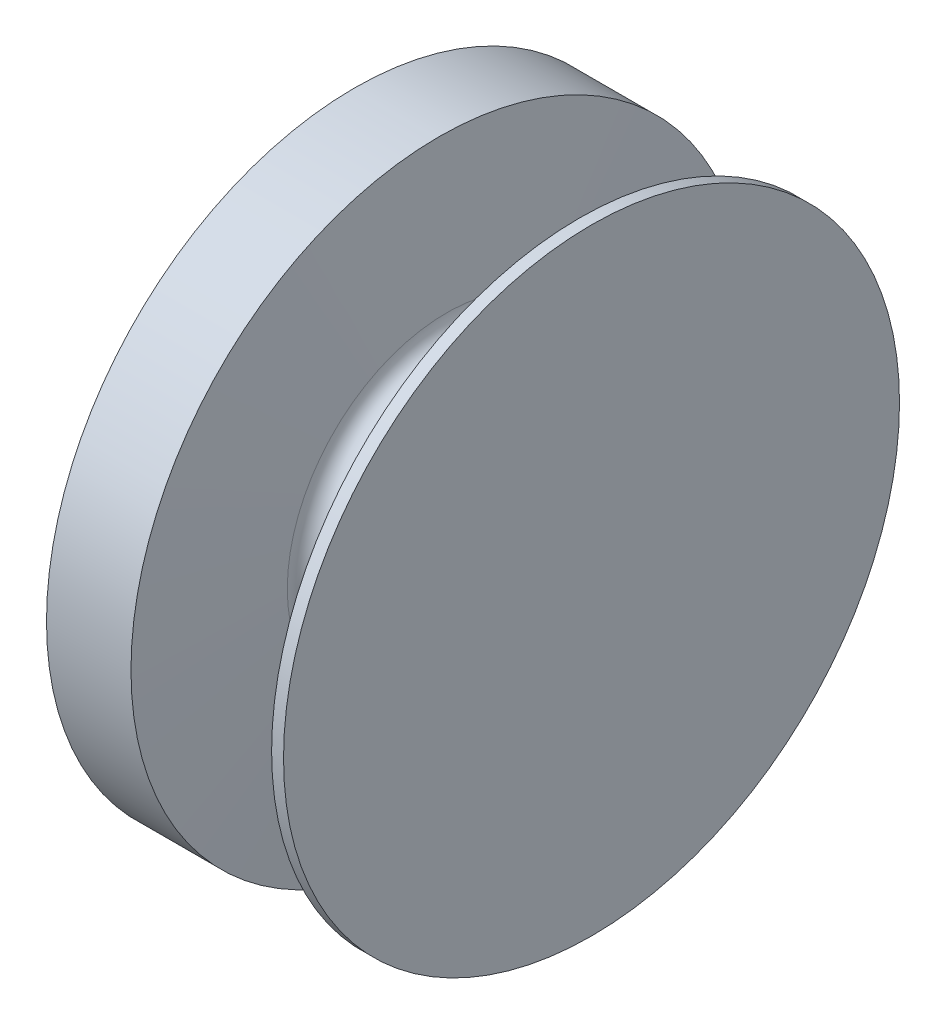
ISO-10303-21;
HEADER;
FILE_DESCRIPTION(('STEP AP214'),'2;1');
FILE_NAME('part.step','',(''),(''),'','','');
FILE_SCHEMA(('AUTOMOTIVE_DESIGN { 1 0 10303 214 1 1 1 1 }'));
ENDSEC;
DATA;
#1=APPLICATION_CONTEXT('core data for automotive mechanical design processes');
#2=APPLICATION_PROTOCOL_DEFINITION('international standard','automotive_design',2000,#1);
#3=PRODUCT_CONTEXT('',#1,'mechanical');
#4=PRODUCT('Part','Part','',(#3));
#5=PRODUCT_RELATED_PRODUCT_CATEGORY('part','',(#4));
#6=PRODUCT_DEFINITION_FORMATION('','',#4);
#7=PRODUCT_DEFINITION_CONTEXT('part definition',#1,'design');
#8=PRODUCT_DEFINITION('design','',#6,#7);
#9=PRODUCT_DEFINITION_SHAPE('','',#8);
#10=(LENGTH_UNIT() NAMED_UNIT(*) SI_UNIT(.MILLI.,.METRE.));
#11=(NAMED_UNIT(*) PLANE_ANGLE_UNIT() SI_UNIT($,.RADIAN.));
#12=(NAMED_UNIT(*) SI_UNIT($,.STERADIAN.) SOLID_ANGLE_UNIT());
#13=UNCERTAINTY_MEASURE_WITH_UNIT(LENGTH_MEASURE(1.E-05),#10,'distance_accuracy_value','');
#14=(GEOMETRIC_REPRESENTATION_CONTEXT(3) GLOBAL_UNCERTAINTY_ASSIGNED_CONTEXT((#13)) GLOBAL_UNIT_ASSIGNED_CONTEXT((#10,
#11,#12)) REPRESENTATION_CONTEXT('',''));
#15=CARTESIAN_POINT('',(0.,0.,0.));
#16=DIRECTION('',(0.,0.,1.));
#17=DIRECTION('',(1.,0.,0.));
#18=AXIS2_PLACEMENT_3D('',#15,#16,#17);
#19=CARTESIAN_POINT('',(-625.555880601787,0.,0.));
#20=DIRECTION('',(-1.,0.,0.));
#21=DIRECTION('',(0.,0.,1.));
#22=AXIS2_PLACEMENT_3D('',#19,#20,#21);
#23=CYLINDRICAL_SURFACE('',#22,439.);
#24=DIRECTION('',(-1.,0.,0.));
#25=VECTOR('',#24,1.);
#26=CARTESIAN_POINT('',(-625.555880601787,355.158460530599,-258.037725756399));
#27=LINE('',#26,#25);
#28=CARTESIAN_POINT('',(131.,355.158460530602,-258.037725756396));
#29=VERTEX_POINT('',#28);
#30=CARTESIAN_POINT('',(72.0000000000001,355.158460530602,-258.037725756397));
#31=VERTEX_POINT('',#30);
#32=EDGE_CURVE('E845',#29,#31,#27,.T.);
#33=ORIENTED_EDGE('',*,*,#32,.F.);
#34=CARTESIAN_POINT('',(131.,0.,0.));
#35=DIRECTION('',(1.,0.,0.));
#36=DIRECTION('',(0.,0.,-1.));
#37=AXIS2_PLACEMENT_3D('',#34,#35,#36);
#38=CIRCLE('',#37,439.);
#39=CARTESIAN_POINT('',(131.,355.158460530602,258.037725756396));
#40=VERTEX_POINT('',#39);
#41=EDGE_CURVE('E12',#40,#29,#38,.F.);
#42=ORIENTED_EDGE('',*,*,#41,.F.);
#43=DIRECTION('',(-1.,0.,0.));
#44=VECTOR('',#43,1.);
#45=CARTESIAN_POINT('',(-625.555880601787,355.158460530602,258.037725756396));
#46=LINE('',#45,#44);
#47=CARTESIAN_POINT('',(72.0000000000001,355.158460530601,258.037725756397));
#48=VERTEX_POINT('',#47);
#49=EDGE_CURVE('E376',#48,#40,#46,.F.);
#50=ORIENTED_EDGE('',*,*,#49,.F.);
#51=CARTESIAN_POINT('',(72.0000000000001,0.,0.));
#52=DIRECTION('',(-1.,0.,0.));
#53=DIRECTION('',(0.,0.,1.));
#54=AXIS2_PLACEMENT_3D('',#51,#52,#53);
#55=CIRCLE('',#54,439.);
#56=EDGE_CURVE('E380',#48,#31,#55,.F.);
#57=ORIENTED_EDGE('',*,*,#56,.T.);
#58=EDGE_LOOP('',(#33,#42,#50,#57));
#59=FACE_BOUND('',#58,.T.);
#60=CARTESIAN_POINT('',(135.485572847179,0.,0.));
#61=DIRECTION('',(-1.,0.,0.));
#62=DIRECTION('',(0.,0.,1.));
#63=AXIS2_PLACEMENT_3D('',#60,#61,#62);
#64=CIRCLE('',#63,439.);
#65=CARTESIAN_POINT('',(135.485572847179,0.,439.));
#66=VERTEX_POINT('',#65);
#67=EDGE_CURVE('E862',#66,#66,#64,.T.);
#68=ORIENTED_EDGE('',*,*,#67,.T.);
#69=EDGE_LOOP('',(#68));
#70=FACE_BOUND('',#69,.T.);
#71=ADVANCED_FACE('F357',(#59,#70),#23,.T.);
#72=CARTESIAN_POINT('',(135.485572847179,0.,0.));
#73=DIRECTION('',(-1.,0.,0.));
#74=DIRECTION('',(0.,0.,1.));
#75=AXIS2_PLACEMENT_3D('',#72,#73,#74);
#76=TOROIDAL_SURFACE('',#75,497.5,58.5);
#77=CARTESIAN_POINT('',(193.905400630322,0.,0.));
#78=DIRECTION('',(-1.,0.,0.));
#79=DIRECTION('',(0.,0.,1.));
#80=AXIS2_PLACEMENT_3D('',#77,#78,#79);
#81=CIRCLE('',#80,494.438346559789);
#82=CARTESIAN_POINT('',(193.905400630322,0.,494.438346559789));
#83=VERTEX_POINT('',#82);
#84=EDGE_CURVE('E859',#83,#83,#81,.T.);
#85=ORIENTED_EDGE('',*,*,#84,.T.);
#86=EDGE_LOOP('',(#85));
#87=FACE_BOUND('',#86,.T.);
#88=ORIENTED_EDGE('',*,*,#67,.F.);
#89=EDGE_LOOP('',(#88));
#90=FACE_BOUND('',#89,.T.);
#91=ADVANCED_FACE('F903',(#87,#90),#76,.F.);
#92=CARTESIAN_POINT('',(193.905400630322,0.,0.));
#93=DIRECTION('',(1.,0.,0.));
#94=DIRECTION('',(0.,0.,-1.));
#95=AXIS2_PLACEMENT_3D('',#92,#93,#94);
#96=CONICAL_SURFACE('',#95,494.438346559789,1.51843644923507);
#97=CARTESIAN_POINT('',(218.042414110046,0.,0.));
#98=DIRECTION('',(-1.,0.,0.));
#99=DIRECTION('',(0.,0.,1.));
#100=AXIS2_PLACEMENT_3D('',#97,#98,#99);
#101=CIRCLE('',#100,955.);
#102=CARTESIAN_POINT('',(218.042414110046,0.,955.));
#103=VERTEX_POINT('',#102);
#104=EDGE_CURVE('E856',#103,#103,#101,.T.);
#105=ORIENTED_EDGE('',*,*,#104,.T.);
#106=EDGE_LOOP('',(#105));
#107=FACE_BOUND('',#106,.T.);
#108=ORIENTED_EDGE('',*,*,#84,.F.);
#109=EDGE_LOOP('',(#108));
#110=FACE_BOUND('',#109,.T.);
#111=ADVANCED_FACE('F909',(#107,#110),#96,.T.);
#112=CARTESIAN_POINT('',(255.,0.,0.));
#113=DIRECTION('',(-1.,0.,0.));
#114=DIRECTION('',(0.,0.,1.));
#115=AXIS2_PLACEMENT_3D('',#112,#113,#114);
#116=PLANE('',#115);
#117=CARTESIAN_POINT('',(255.,0.,0.));
#118=DIRECTION('',(-1.,0.,0.));
#119=DIRECTION('',(0.,0.,1.));
#120=AXIS2_PLACEMENT_3D('',#117,#118,#119);
#121=CIRCLE('',#120,955.);
#122=CARTESIAN_POINT('',(255.,0.,955.));
#123=VERTEX_POINT('',#122);
#124=EDGE_CURVE('E368',#123,#123,#121,.T.);
#125=ORIENTED_EDGE('',*,*,#124,.F.);
#126=EDGE_LOOP('',(#125));
#127=FACE_BOUND('',#126,.T.);
#128=ADVANCED_FACE('F359',(#127),#116,.F.);
#129=CARTESIAN_POINT('',(-625.555880601787,0.,0.));
#130=DIRECTION('',(-1.,0.,0.));
#131=DIRECTION('',(0.,0.,1.));
#132=AXIS2_PLACEMENT_3D('',#129,#130,#131);
#133=CYLINDRICAL_SURFACE('',#132,955.);
#134=ORIENTED_EDGE('',*,*,#124,.T.);
#135=EDGE_LOOP('',(#134));
#136=FACE_BOUND('',#135,.T.);
#137=ORIENTED_EDGE('',*,*,#104,.F.);
#138=EDGE_LOOP('',(#137));
#139=FACE_BOUND('',#138,.T.);
#140=ADVANCED_FACE('F889',(#136,#139),#133,.T.);
#141=CARTESIAN_POINT('',(0.,0.,0.));
#142=DIRECTION('',(-1.,0.,0.));
#143=DIRECTION('',(0.,0.,1.));
#144=AXIS2_PLACEMENT_3D('',#141,#142,#143);
#145=TOROIDAL_SURFACE('',#144,384.5,72.);
#146=CARTESIAN_POINT('',(72.,0.,0.));
#147=DIRECTION('',(-1.,0.,0.));
#148=DIRECTION('',(0.,0.,1.));
#149=AXIS2_PLACEMENT_3D('',#146,#147,#148);
#150=CIRCLE('',#149,384.5);
#151=CARTESIAN_POINT('',(72.,0.,384.5));
#152=VERTEX_POINT('',#151);
#153=EDGE_CURVE('E855',#152,#152,#150,.T.);
#154=ORIENTED_EDGE('',*,*,#153,.T.);
#155=EDGE_LOOP('',(#154));
#156=FACE_BOUND('',#155,.T.);
#157=CARTESIAN_POINT('',(-72.,0.,0.));
#158=DIRECTION('',(-1.,0.,0.));
#159=DIRECTION('',(0.,0.,1.));
#160=AXIS2_PLACEMENT_3D('',#157,#158,#159);
#161=CIRCLE('',#160,384.5);
#162=CARTESIAN_POINT('',(-72.,0.,384.5));
#163=VERTEX_POINT('',#162);
#164=EDGE_CURVE('E850',#163,#163,#161,.T.);
#165=ORIENTED_EDGE('',*,*,#164,.F.);
#166=EDGE_LOOP('',(#165));
#167=FACE_BOUND('',#166,.T.);
#168=ADVANCED_FACE('F782',(#156,#167),#145,.F.);
#169=CARTESIAN_POINT('',(72.,384.5,0.));
#170=DIRECTION('',(-1.,0.,0.));
#171=DIRECTION('',(0.,0.,1.));
#172=AXIS2_PLACEMENT_3D('',#169,#170,#171);
#173=PLANE('',#172);
#174=ORIENTED_EDGE('',*,*,#153,.F.);
#175=EDGE_LOOP('',(#174));
#176=FACE_BOUND('',#175,.T.);
#177=ORIENTED_EDGE('',*,*,#56,.F.);
#178=CARTESIAN_POINT('',(72.,1083.27375546805,787.044452819624));
#179=DIRECTION('',(1.,0.,0.));
#180=DIRECTION('',(0.,0.,-1.));
#181=AXIS2_PLACEMENT_3D('',#178,#179,#180);
#182=CIRCLE('',#181,900.);
#183=CARTESIAN_POINT('',(72.,472.970901093865,125.583625602533));
#184=VERTEX_POINT('',#183);
#185=EDGE_CURVE('E467',#48,#184,#182,.T.);
#186=ORIENTED_EDGE('',*,*,#185,.T.);
#187=CARTESIAN_POINT('',(72.,612.662443317053,276.984659387997));
#188=DIRECTION('',(1.,0.,0.));
#189=DIRECTION('',(0.,0.,-1.));
#190=AXIS2_PLACEMENT_3D('',#187,#188,#189);
#191=CIRCLE('',#190,206.);
#192=CARTESIAN_POINT('',(72.,571.297891920709,75.1803633787711));
#193=VERTEX_POINT('',#192);
#194=EDGE_CURVE('E839',#184,#193,#191,.T.);
#195=ORIENTED_EDGE('',*,*,#194,.T.);
#196=CARTESIAN_POINT('',(72.,519.491803278689,-177.564822885211));
#197=DIRECTION('',(-1.,0.,0.));
#198=DIRECTION('',(0.,0.,-1.));
#199=AXIS2_PLACEMENT_3D('',#196,#197,#198);
#200=CIRCLE('',#199,258.);
#201=CARTESIAN_POINT('',(72.,687.526094577917,18.2117767061756));
#202=VERTEX_POINT('',#201);
#203=EDGE_CURVE('E834',#193,#202,#200,.T.);
#204=ORIENTED_EDGE('',*,*,#203,.T.);
#205=CARTESIAN_POINT('',(72.,671.894997712872,0.));
#206=DIRECTION('',(-1.,0.,0.));
#207=DIRECTION('',(0.,0.,1.));
#208=AXIS2_PLACEMENT_3D('',#205,#206,#207);
#209=CIRCLE('',#208,24.);
#210=CARTESIAN_POINT('',(72.,687.526094578365,-18.2117767057907));
#211=VERTEX_POINT('',#210);
#212=EDGE_CURVE('E826',#202,#211,#209,.T.);
#213=ORIENTED_EDGE('',*,*,#212,.T.);
#214=CARTESIAN_POINT('',(72.,519.491803278689,177.564822885211));
#215=DIRECTION('',(-1.,0.,0.));
#216=DIRECTION('',(0.,0.,1.));
#217=AXIS2_PLACEMENT_3D('',#214,#215,#216);
#218=CIRCLE('',#217,258.);
#219=CARTESIAN_POINT('',(72.,571.297891920762,-75.1803633787604));
#220=VERTEX_POINT('',#219);
#221=EDGE_CURVE('E825',#211,#220,#218,.T.);
#222=ORIENTED_EDGE('',*,*,#221,.T.);
#223=CARTESIAN_POINT('',(72.,612.662443317053,-276.984659387997));
#224=DIRECTION('',(1.,0.,0.));
#225=DIRECTION('',(0.,0.,1.));
#226=AXIS2_PLACEMENT_3D('',#223,#224,#225);
#227=CIRCLE('',#226,206.);
#228=CARTESIAN_POINT('',(72.,472.970901093382,-125.583625602978));
#229=VERTEX_POINT('',#228);
#230=EDGE_CURVE('E761',#220,#229,#227,.T.);
#231=ORIENTED_EDGE('',*,*,#230,.T.);
#232=CARTESIAN_POINT('',(72.,1083.27375546805,-787.044452819624));
#233=DIRECTION('',(1.,0.,0.));
#234=DIRECTION('',(0.,0.,1.));
#235=AXIS2_PLACEMENT_3D('',#232,#233,#234);
#236=CIRCLE('',#235,900.);
#237=EDGE_CURVE('E724',#229,#31,#236,.T.);
#238=ORIENTED_EDGE('',*,*,#237,.T.);
#239=EDGE_LOOP('',(#177,#186,#195,#204,#213,#222,#231,#238));
#240=FACE_BOUND('',#239,.T.);
#241=ADVANCED_FACE('F773',(#176,#240),#173,.T.);
#242=CARTESIAN_POINT('',(-72.,384.5,0.));
#243=DIRECTION('',(1.,0.,0.));
#244=DIRECTION('',(0.,0.,-1.));
#245=AXIS2_PLACEMENT_3D('',#242,#243,#244);
#246=PLANE('',#245);
#247=CARTESIAN_POINT('',(-72.0000000000001,0.,0.));
#248=DIRECTION('',(1.,0.,0.));
#249=DIRECTION('',(0.,0.,-1.));
#250=AXIS2_PLACEMENT_3D('',#247,#248,#249);
#251=CIRCLE('',#250,439.);
#252=CARTESIAN_POINT('',(-72.0000000000001,0.,-439.));
#253=VERTEX_POINT('',#252);
#254=EDGE_CURVE('E879',#253,#253,#251,.F.);
#255=ORIENTED_EDGE('',*,*,#254,.F.);
#256=EDGE_LOOP('',(#255));
#257=FACE_BOUND('',#256,.T.);
#258=ORIENTED_EDGE('',*,*,#164,.T.);
#259=EDGE_LOOP('',(#258));
#260=FACE_BOUND('',#259,.T.);
#261=ADVANCED_FACE('F643',(#257,#260),#246,.T.);
#262=CARTESIAN_POINT('',(-480.,955.,0.));
#263=DIRECTION('',(1.,0.,0.));
#264=DIRECTION('',(0.,0.,-1.));
#265=AXIS2_PLACEMENT_3D('',#262,#263,#264);
#266=PLANE('',#265);
#267=CARTESIAN_POINT('',(-480.,0.,0.));
#268=DIRECTION('',(-1.,0.,0.));
#269=DIRECTION('',(0.,0.,1.));
#270=AXIS2_PLACEMENT_3D('',#267,#268,#269);
#271=CIRCLE('',#270,955.);
#272=CARTESIAN_POINT('',(-480.,0.,955.));
#273=VERTEX_POINT('',#272);
#274=EDGE_CURVE('E874',#273,#273,#271,.T.);
#275=ORIENTED_EDGE('',*,*,#274,.T.);
#276=EDGE_LOOP('',(#275));
#277=FACE_BOUND('',#276,.T.);
#278=ADVANCED_FACE('F893',(#277),#266,.F.);
#279=ORIENTED_EDGE('',*,*,#274,.F.);
#280=EDGE_LOOP('',(#279));
#281=FACE_BOUND('',#280,.T.);
#282=CARTESIAN_POINT('',(-218.042414110046,0.,0.));
#283=DIRECTION('',(-1.,0.,0.));
#284=DIRECTION('',(0.,0.,1.));
#285=AXIS2_PLACEMENT_3D('',#282,#283,#284);
#286=CIRCLE('',#285,955.);
#287=CARTESIAN_POINT('',(-218.042414110046,0.,955.));
#288=VERTEX_POINT('',#287);
#289=EDGE_CURVE('E871',#288,#288,#286,.T.);
#290=ORIENTED_EDGE('',*,*,#289,.T.);
#291=EDGE_LOOP('',(#290));
#292=FACE_BOUND('',#291,.T.);
#293=ADVANCED_FACE('F898',(#281,#292),#133,.T.);
#294=CARTESIAN_POINT('',(-218.042414110046,0.,0.));
#295=DIRECTION('',(-1.,0.,0.));
#296=DIRECTION('',(0.,0.,1.));
#297=AXIS2_PLACEMENT_3D('',#294,#295,#296);
#298=CONICAL_SURFACE('',#297,955.,1.51843644923507);
#299=CARTESIAN_POINT('',(-193.905400630322,0.,0.));
#300=DIRECTION('',(-1.,0.,0.));
#301=DIRECTION('',(0.,0.,1.));
#302=AXIS2_PLACEMENT_3D('',#299,#300,#301);
#303=CIRCLE('',#302,494.438346559789);
#304=CARTESIAN_POINT('',(-193.905400630322,0.,494.438346559789));
#305=VERTEX_POINT('',#304);
#306=EDGE_CURVE('E868',#305,#305,#303,.T.);
#307=ORIENTED_EDGE('',*,*,#306,.T.);
#308=EDGE_LOOP('',(#307));
#309=FACE_BOUND('',#308,.T.);
#310=ORIENTED_EDGE('',*,*,#289,.F.);
#311=EDGE_LOOP('',(#310));
#312=FACE_BOUND('',#311,.T.);
#313=ADVANCED_FACE('F922',(#309,#312),#298,.T.);
#314=CARTESIAN_POINT('',(-135.485572847179,0.,0.));
#315=DIRECTION('',(-1.,0.,0.));
#316=DIRECTION('',(0.,0.,1.));
#317=AXIS2_PLACEMENT_3D('',#314,#315,#316);
#318=TOROIDAL_SURFACE('',#317,497.5,58.5);
#319=CARTESIAN_POINT('',(-135.485572847179,0.,0.));
#320=DIRECTION('',(-1.,0.,0.));
#321=DIRECTION('',(0.,0.,1.));
#322=AXIS2_PLACEMENT_3D('',#319,#320,#321);
#323=CIRCLE('',#322,439.);
#324=CARTESIAN_POINT('',(-135.485572847179,0.,439.));
#325=VERTEX_POINT('',#324);
#326=EDGE_CURVE('E865',#325,#325,#323,.T.);
#327=ORIENTED_EDGE('',*,*,#326,.T.);
#328=EDGE_LOOP('',(#327));
#329=FACE_BOUND('',#328,.T.);
#330=ORIENTED_EDGE('',*,*,#306,.F.);
#331=EDGE_LOOP('',(#330));
#332=FACE_BOUND('',#331,.T.);
#333=ADVANCED_FACE('F915',(#329,#332),#318,.F.);
#334=ORIENTED_EDGE('',*,*,#326,.F.);
#335=EDGE_LOOP('',(#334));
#336=FACE_BOUND('',#335,.T.);
#337=ORIENTED_EDGE('',*,*,#254,.T.);
#338=EDGE_LOOP('',(#337));
#339=FACE_BOUND('',#338,.T.);
#340=ADVANCED_FACE('F905',(#336,#339),#23,.T.);
#341=CARTESIAN_POINT('',(101.,360.821579491226,-262.152222522444));
#342=DIRECTION('',(0.,-0.587785252292475,-0.809016994374946));
#343=DIRECTION('',(0.,-0.809016994374946,0.587785252292475));
#344=AXIS2_PLACEMENT_3D('',#341,#342,#343);
#345=PLANE('',#344);
#346=DIRECTION('',(0.972082208573286,0.189828178850254,-0.137918244948512));
#347=VECTOR('',#346,1.);
#348=CARTESIAN_POINT('',(86.5,357.990020010914,-260.09497413942));
#349=LINE('',#348,#347);
#350=CARTESIAN_POINT('',(101.,360.821579491226,-262.152222522444));
#351=VERTEX_POINT('',#350);
#352=EDGE_CURVE('E742',#31,#351,#349,.T.);
#353=ORIENTED_EDGE('',*,*,#352,.T.);
#354=DIRECTION('',(0.973841209741793,0.183832620650878,-0.133562216937544));
#355=VECTOR('',#354,1.);
#356=CARTESIAN_POINT('',(116.,363.653138971539,-264.209470905467));
#357=LINE('',#356,#355);
#358=CARTESIAN_POINT('',(131.,366.484698451851,-266.266719288491));
#359=VERTEX_POINT('',#358);
#360=EDGE_CURVE('E475',#351,#359,#357,.T.);
#361=ORIENTED_EDGE('',*,*,#360,.T.);
#362=DIRECTION('',(0.,-0.809016994374946,0.587785252292475));
#363=VECTOR('',#362,1.);
#364=CARTESIAN_POINT('',(131.,366.484698451851,-266.266719288491));
#365=LINE('',#364,#363);
#366=EDGE_CURVE('E607',#359,#29,#365,.T.);
#367=ORIENTED_EDGE('',*,*,#366,.T.);
#368=ORIENTED_EDGE('',*,*,#32,.T.);
#369=EDGE_LOOP('',(#353,#361,#367,#368));
#370=FACE_BOUND('',#369,.T.);
#371=ADVANCED_FACE('F497',(#370),#345,.T.);
#372=CARTESIAN_POINT('',(101.,0.,0.));
#373=DIRECTION('',(0.,-0.587785252292475,0.809016994374946));
#374=DIRECTION('',(0.,0.809016994374946,0.587785252292475));
#375=AXIS2_PLACEMENT_3D('',#372,#373,#374);
#376=PLANE('',#375);
#377=DIRECTION('',(-0.972082208573286,-0.189828178850254,-0.137918244948512));
#378=VECTOR('',#377,1.);
#379=CARTESIAN_POINT('',(86.5,357.990020010914,260.09497413942));
#380=LINE('',#379,#378);
#381=CARTESIAN_POINT('',(101.,360.821579491226,262.152222522444));
#382=VERTEX_POINT('',#381);
#383=EDGE_CURVE('E760',#382,#48,#380,.T.);
#384=ORIENTED_EDGE('',*,*,#383,.T.);
#385=ORIENTED_EDGE('',*,*,#49,.T.);
#386=DIRECTION('',(0.,0.809016994374946,0.587785252292475));
#387=VECTOR('',#386,1.);
#388=CARTESIAN_POINT('',(131.,366.484698451851,266.266719288491));
#389=LINE('',#388,#387);
#390=CARTESIAN_POINT('',(131.,366.484698451851,266.266719288491));
#391=VERTEX_POINT('',#390);
#392=EDGE_CURVE('E618',#40,#391,#389,.T.);
#393=ORIENTED_EDGE('',*,*,#392,.T.);
#394=DIRECTION('',(-0.973841209741793,-0.183832620650877,-0.133562216937542));
#395=VECTOR('',#394,1.);
#396=CARTESIAN_POINT('',(116.,363.653138971538,264.209470905467));
#397=LINE('',#396,#395);
#398=EDGE_CURVE('E1089',#391,#382,#397,.T.);
#399=ORIENTED_EDGE('',*,*,#398,.T.);
#400=EDGE_LOOP('',(#384,#385,#393,#399));
#401=FACE_BOUND('',#400,.T.);
#402=ADVANCED_FACE('F627',(#401),#376,.T.);
#403=CARTESIAN_POINT('',(101.,360.821579491226,262.152222522444));
#404=CARTESIAN_POINT('',(72.,355.158460530601,258.037725756397));
#405=CARTESIAN_POINT('',(101.,367.393808127177,253.106325850718));
#406=CARTESIAN_POINT('',(72.,363.85550578712,246.067269903805));
#407=CARTESIAN_POINT('',(101.,380.459758180348,235.821134093465));
#408=CARTESIAN_POINT('',(72.0000000000001,382.397522321496,221.803640336879));
#409=CARTESIAN_POINT('',(101.,397.286804827532,215.117466393958));
#410=CARTESIAN_POINT('',(71.9999999999999,407.532019680206,192.247216790442));
#411=CARTESIAN_POINT('',(101.,411.466413214162,198.601124407147));
#412=CARTESIAN_POINT('',(72.,427.951342819584,170.021861956772));
#413=CARTESIAN_POINT('',(101.,422.608701363738,186.094150203169));
#414=CARTESIAN_POINT('',(72.0000000000001,443.23440206688,154.188896592306));
#415=CARTESIAN_POINT('',(101.,434.441338621763,173.30649775446));
#416=CARTESIAN_POINT('',(72.0000000000001,458.298732473496,139.318140747675));
#417=CARTESIAN_POINT('',(101.,442.972005142304,164.444846869737));
#418=CARTESIAN_POINT('',(72.,468.127311114572,130.05260799446));
#419=CARTESIAN_POINT('',(101.,451.208273317703,156.075815556393));
#420=CARTESIAN_POINT('',(72.,476.990206489782,121.875176885997));
#421=CARTESIAN_POINT('',(101.,459.17362423093,148.464851216944));
#422=CARTESIAN_POINT('',(72.0000000000001,484.843492704245,115.210592946971));
#423=CARTESIAN_POINT('',(101.,472.692312548408,137.201127504243));
#424=CARTESIAN_POINT('',(71.9999999999998,496.420865752931,106.722916742573));
#425=CARTESIAN_POINT('',(101.,487.765828758402,126.384042003003));
#426=CARTESIAN_POINT('',(72.0000000000003,507.992659111598,99.387817055562));
#427=CARTESIAN_POINT('',(101.,504.222194070297,116.367785157974));
#428=CARTESIAN_POINT('',(71.9999999999997,519.711795438615,92.9878498943756));
#429=CARTESIAN_POINT('',(101.,521.708357460273,107.511280792621));
#430=CARTESIAN_POINT('',(72.0000000000002,531.71366635238,87.4016732838897));
#431=CARTESIAN_POINT('',(101.,539.730811886226,100.094344922475));
#432=CARTESIAN_POINT('',(71.9999999999998,544.144029804303,82.5580211604183));
#433=CARTESIAN_POINT('',(101.,557.76176601461,94.2512668376236));
#434=CARTESIAN_POINT('',(72.0000000000003,557.185162041015,78.4330154170457));
#435=CARTESIAN_POINT('',(101.,569.486768484049,91.3907288659062));
#436=CARTESIAN_POINT('',(72.,566.452476626982,76.173545555353));
#437=CARTESIAN_POINT('',(101.,581.215465382249,88.949527710208));
#438=CARTESIAN_POINT('',(72.,576.358950691936,74.1429799840552));
#439=CARTESIAN_POINT('',(101.,592.878590378895,86.1040212899953));
#440=CARTESIAN_POINT('',(72.0000000000001,586.610510031966,71.7243461852935));
#441=CARTESIAN_POINT('',(101.,609.596793883529,80.8603472170132));
#442=CARTESIAN_POINT('',(71.9999999999999,602.206665640008,67.0022054896764));
#443=CARTESIAN_POINT('',(101.,625.669104445209,74.6777107972638));
#444=CARTESIAN_POINT('',(72.0000000000001,617.802727967464,61.1666226887952));
#445=CARTESIAN_POINT('',(101.,641.194634189846,67.5629102136879));
#446=CARTESIAN_POINT('',(71.9999999999999,633.15986214129,54.2511890508895));
#447=CARTESIAN_POINT('',(101.,656.250342900898,59.4944350977551));
#448=CARTESIAN_POINT('',(72.,648.020575132525,46.3494399304553));
#449=CARTESIAN_POINT('',(101.,670.899505847132,50.4227757254233));
#450=CARTESIAN_POINT('',(72.,662.178637652372,37.5998626990799));
#451=CARTESIAN_POINT('',(101.,685.196562807556,40.2632587297861));
#452=CARTESIAN_POINT('',(72.,675.434119303757,28.1791186114117));
#453=CARTESIAN_POINT('',(101.,694.526637439809,32.6794497731397));
#454=CARTESIAN_POINT('',(72.,683.614138810362,21.5693930728245));
#455=CARTESIAN_POINT('',(101.,700.05527640313,27.8628387763078));
#456=CARTESIAN_POINT('',(72.,688.292217206611,17.5542166441988));
#457=CARTESIAN_POINT('',(101.,701.825775691786,26.1690397767653));
#458=CARTESIAN_POINT('',(71.9999999999999,689.684961548521,16.1926444852902));
#459=CARTESIAN_POINT('',(101.,705.131383571147,22.3182201788185));
#460=CARTESIAN_POINT('',(72.0000000000001,691.996187464847,13.3275202400966));
#461=CARTESIAN_POINT('',(101.,708.683200529343,16.6389582766446));
#462=CARTESIAN_POINT('',(71.9999999999998,694.106550214979,9.5438494465658));
#463=CARTESIAN_POINT('',(101.,711.521388925013,8.65946354426175));
#464=CARTESIAN_POINT('',(72.0000000000002,695.5743015298,4.81588369859005));
#465=CARTESIAN_POINT('',(101.,712.522436940119,1.2490009027033E-13));
#466=CARTESIAN_POINT('',(72.,696.055193659505,0.));
#467=CARTESIAN_POINT('',(101.,711.521388925014,-8.65946354426145));
#468=CARTESIAN_POINT('',(72.0000000000001,695.574301529802,-4.8158836985902));
#469=CARTESIAN_POINT('',(101.,708.683200529343,-16.6389582766443));
#470=CARTESIAN_POINT('',(71.9999999999999,694.106550214976,-9.54384944656594));
#471=CARTESIAN_POINT('',(101.,705.131383571148,-22.3182201788182));
#472=CARTESIAN_POINT('',(72.,691.996187464849,-13.3275202400966));
#473=CARTESIAN_POINT('',(101.,701.825775691786,-26.1690397767652));
#474=CARTESIAN_POINT('',(72.0000000000001,689.68496154852,-16.1926444852904));
#475=CARTESIAN_POINT('',(101.,700.05527640313,-27.8628387763077));
#476=CARTESIAN_POINT('',(72.,688.292217206611,-17.5542166441988));
#477=CARTESIAN_POINT('',(101.,694.526637439809,-32.6794497731396));
#478=CARTESIAN_POINT('',(72.,683.614138810363,-21.5693930728245));
#479=CARTESIAN_POINT('',(101.,685.196562807556,-40.2632587297862));
#480=CARTESIAN_POINT('',(72.,675.434119303757,-28.1791186114117));
#481=CARTESIAN_POINT('',(101.,670.899505847133,-50.4227757254233));
#482=CARTESIAN_POINT('',(72.,662.178637652371,-37.5998626990799));
#483=CARTESIAN_POINT('',(101.,656.250342900898,-59.4944350977548));
#484=CARTESIAN_POINT('',(72.,648.020575132526,-46.3494399304553));
#485=CARTESIAN_POINT('',(101.,641.194634189847,-67.5629102136879));
#486=CARTESIAN_POINT('',(71.9999999999997,633.15986214129,-54.2511890508896));
#487=CARTESIAN_POINT('',(101.,625.669104445207,-74.6777107972636));
#488=CARTESIAN_POINT('',(72.0000000000003,617.802727967465,-61.1666226887951));
#489=CARTESIAN_POINT('',(101.,609.59679388353,-80.8603472170132));
#490=CARTESIAN_POINT('',(71.9999999999997,602.206665640007,-67.0022054896765));
#491=CARTESIAN_POINT('',(101.,592.878590378895,-86.1040212899953));
#492=CARTESIAN_POINT('',(72.0000000000001,586.610510031967,-71.7243461852933));
#493=CARTESIAN_POINT('',(101.,581.21546538225,-88.9495277102079));
#494=CARTESIAN_POINT('',(72.,576.358950691936,-74.1429799840552));
#495=CARTESIAN_POINT('',(101.,569.486768484049,-91.3907288659062));
#496=CARTESIAN_POINT('',(72.,566.452476626982,-76.173545555353));
#497=CARTESIAN_POINT('',(101.,557.761766014609,-94.2512668376237));
#498=CARTESIAN_POINT('',(72.,557.185162041015,-78.4330154170457));
#499=CARTESIAN_POINT('',(101.,539.730811886228,-100.094344922475));
#500=CARTESIAN_POINT('',(72.,544.144029804303,-82.5580211604183));
#501=CARTESIAN_POINT('',(101.,521.70835746027,-107.511280792622));
#502=CARTESIAN_POINT('',(72.,531.71366635238,-87.4016732838897));
#503=CARTESIAN_POINT('',(101.,504.222194070298,-116.367785157974));
#504=CARTESIAN_POINT('',(72.0000000000001,519.711795438616,-92.9878498943755));
#505=CARTESIAN_POINT('',(101.,487.765828758402,-126.384042003003));
#506=CARTESIAN_POINT('',(72.,507.992659111597,-99.387817055562));
#507=CARTESIAN_POINT('',(101.,472.692312548409,-137.201127504243));
#508=CARTESIAN_POINT('',(72.0000000000001,496.420865752931,-106.722916742573));
#509=CARTESIAN_POINT('',(101.,459.173624230929,-148.464851216943));
#510=CARTESIAN_POINT('',(72.,484.843492704245,-115.210592946971));
#511=CARTESIAN_POINT('',(101.,451.208273317703,-156.075815556393));
#512=CARTESIAN_POINT('',(72.,476.990206489782,-121.875176885997));
#513=CARTESIAN_POINT('',(101.,442.972005142304,-164.444846869737));
#514=CARTESIAN_POINT('',(72.,468.127311114572,-130.05260799446));
#515=CARTESIAN_POINT('',(101.,434.441338621763,-173.30649775446));
#516=CARTESIAN_POINT('',(72.,458.298732473496,-139.318140747675));
#517=CARTESIAN_POINT('',(101.,422.608701363738,-186.094150203169));
#518=CARTESIAN_POINT('',(71.9999999999999,443.23440206688,-154.188896592306));
#519=CARTESIAN_POINT('',(101.,411.466413214161,-198.601124407147));
#520=CARTESIAN_POINT('',(72.0000000000001,427.951342819584,-170.021861956772));
#521=CARTESIAN_POINT('',(101.,397.286804827533,-215.117466393957));
#522=CARTESIAN_POINT('',(72.0000000000002,407.532019680205,-192.247216790442));
#523=CARTESIAN_POINT('',(101.,380.459758180348,-235.821134093465));
#524=CARTESIAN_POINT('',(71.9999999999999,382.397522321497,-221.803640336879));
#525=CARTESIAN_POINT('',(101.,367.393808127178,-253.106325850717));
#526=CARTESIAN_POINT('',(72.,363.85550578712,-246.067269903804));
#527=CARTESIAN_POINT('',(101.,360.821579491226,-262.152222522444));
#528=CARTESIAN_POINT('',(72.,355.158460530601,-258.037725756396));
#529=B_SPLINE_SURFACE_WITH_KNOTS('',3,1,((#403,#404),(#405,#406),(#407,#408),(#409,#410),(#411,
#412),(#413,#414),(#415,#416),(#417,#418),(#419,#420),(#421,#422),(#423,#424),(#425,#426),(#427,
#428),(#429,#430),(#431,#432),(#433,#434),(#435,#436),(#437,#438),(#439,#440),(#441,#442),(#443,
#444),(#445,#446),(#447,#448),(#449,#450),(#451,#452),(#453,#454),(#455,#456),(#457,#458),(#459,
#460),(#461,#462),(#463,#464),(#465,#466),(#467,#468),(#469,#470),(#471,#472),(#473,#474),(#475,
#476),(#477,#478),(#479,#480),(#481,#482),(#483,#484),(#485,#486),(#487,#488),(#489,#490),(#491,
#492),(#493,#494),(#495,#496),(#497,#498),(#499,#500),(#501,#502),(#503,#504),(#505,#506),(#507,
#508),(#509,#510),(#511,#512),(#513,#514),(#515,#516),(#517,#518),(#519,#520),(#521,#522),(#523,
#524),(#525,#526),(#527,#528)),.UNSPECIFIED.,.F.,.F.,.F.,(4,1,1,1,1,1,2,1,1,1,1,1,1,1,2,1,1,1,1,
1,1,1,2,1,1,1,1,1,1,1,1,1,2,1,1,1,1,1,1,1,2,1,1,1,1,1,1,1,2,1,1,1,1,1,4),(2,2),(0.,
0.0436099954225863,0.0872199908451726,0.109024988556466,0.130829986267759,0.152634983979052,
0.174439981690345,0.192534194074176,0.210628406458008,0.228722618841839,0.24681683122567,
0.264911043609502,0.283005255993333,0.301099468377165,0.319193680760996,0.338093169601832,
0.356992658442669,0.375892147283505,0.394791636124342,0.413691124965178,0.432590613806015,
0.451490102646851,0.470389591487688,0.474090892551727,0.477792193615766,0.485194795743844,
0.492597397871922,0.5,0.507402602128078,0.514805204256156,0.522207806384234,0.525909107448273,
0.529610408512313,0.548509897353149,0.567409386193986,0.586308875034822,0.605208363875658,
0.624107852716495,0.643007341557331,0.661906830398168,0.680806319239004,0.698900531622836,
0.716994744006667,0.735088956390498,0.75318316877433,0.771277381158161,0.789371593541992,
0.807465805925824,0.825560018309655,0.847365016020948,0.869170013732241,0.890975011443534,
0.912780009154827,0.956390004577414,1.),(0.,1.),.UNSPECIFIED.);
#530=CARTESIAN_POINT('',(101.,1088.93687442868,791.158949585671));
#531=DIRECTION('',(1.,0.,0.));
#532=DIRECTION('',(0.,0.,-1.));
#533=AXIS2_PLACEMENT_3D('',#530,#531,#532);
#534=CIRCLE('',#533,900.);
#535=CARTESIAN_POINT('',(101.,447.473142113357,159.871154579227));
#536=VERTEX_POINT('',#535);
#537=EDGE_CURVE('E846',#382,#536,#534,.T.);
#538=CARTESIAN_POINT('',(101.,626.370249681297,335.93030629769));
#539=DIRECTION('',(1.,0.,0.));
#540=DIRECTION('',(0.,0.,-1.));
#541=AXIS2_PLACEMENT_3D('',#538,#539,#540);
#542=CIRCLE('',#541,251.);
#543=CARTESIAN_POINT('',(101.,575.223462174996,90.1966982425745));
#544=VERTEX_POINT('',#543);
#545=EDGE_CURVE('E1078',#536,#544,#542,.T.);
#546=CARTESIAN_POINT('',(101.,519.491803278689,-177.564822885211));
#547=DIRECTION('',(-1.,0.,0.));
#548=DIRECTION('',(0.,0.,-1.));
#549=AXIS2_PLACEMENT_3D('',#546,#547,#548);
#550=CIRCLE('',#549,273.5);
#551=CARTESIAN_POINT('',(101.,699.149858610382,28.6516487033462));
#552=VERTEX_POINT('',#551);
#553=EDGE_CURVE('E1079',#544,#552,#550,.T.);
#554=CARTESIAN_POINT('',(101.,674.188227522249,0.));
#555=DIRECTION('',(-1.,0.,0.));
#556=DIRECTION('',(0.,0.,1.));
#557=AXIS2_PLACEMENT_3D('',#554,#555,#556);
#558=CIRCLE('',#557,38.);
#559=CARTESIAN_POINT('',(101.,699.149858610382,-28.6516487033462));
#560=VERTEX_POINT('',#559);
#561=EDGE_CURVE('E1086',#552,#560,#558,.T.);
#562=CARTESIAN_POINT('',(101.,519.491803278689,177.564822885211));
#563=DIRECTION('',(-1.,0.,0.));
#564=DIRECTION('',(0.,0.,1.));
#565=AXIS2_PLACEMENT_3D('',#562,#563,#564);
#566=CIRCLE('',#565,273.5);
#567=CARTESIAN_POINT('',(101.,575.223462174996,-90.1966982425745));
#568=VERTEX_POINT('',#567);
#569=EDGE_CURVE('E746',#560,#568,#566,.T.);
#570=CARTESIAN_POINT('',(101.,626.370249681297,-335.93030629769));
#571=DIRECTION('',(1.,0.,0.));
#572=DIRECTION('',(0.,0.,1.));
#573=AXIS2_PLACEMENT_3D('',#570,#571,#572);
#574=CIRCLE('',#573,251.);
#575=CARTESIAN_POINT('',(101.,447.473142113358,-159.871154579226));
#576=VERTEX_POINT('',#575);
#577=EDGE_CURVE('E741',#568,#576,#574,.T.);
#578=CARTESIAN_POINT('',(101.,1088.93687442868,-791.158949585671));
#579=DIRECTION('',(1.,0.,0.));
#580=DIRECTION('',(0.,0.,1.));
#581=AXIS2_PLACEMENT_3D('',#578,#579,#580);
#582=CIRCLE('',#581,900.);
#583=EDGE_CURVE('E568',#576,#351,#582,.T.);
#584=ORIENTED_EDGE('',*,*,#537,.T.);
#585=ORIENTED_EDGE('',*,*,#545,.T.);
#586=ORIENTED_EDGE('',*,*,#553,.T.);
#587=ORIENTED_EDGE('',*,*,#561,.T.);
#588=ORIENTED_EDGE('',*,*,#569,.T.);
#589=ORIENTED_EDGE('',*,*,#577,.T.);
#590=ORIENTED_EDGE('',*,*,#583,.T.);
#591=ORIENTED_EDGE('',*,*,#352,.F.);
#592=ORIENTED_EDGE('',*,*,#237,.F.);
#593=ORIENTED_EDGE('',*,*,#230,.F.);
#594=ORIENTED_EDGE('',*,*,#221,.F.);
#595=ORIENTED_EDGE('',*,*,#212,.F.);
#596=ORIENTED_EDGE('',*,*,#203,.F.);
#597=ORIENTED_EDGE('',*,*,#194,.F.);
#598=ORIENTED_EDGE('',*,*,#185,.F.);
#599=ORIENTED_EDGE('',*,*,#383,.F.);
#600=EDGE_LOOP('',(#584,#585,#586,#587,#588,#589,#590,#591,#592,#593,#594,#595,#596,#597,#598,#599));
#601=FACE_BOUND('',#600,.T.);
#602=ADVANCED_FACE('F636',(#601),#529,.T.);
#603=CARTESIAN_POINT('',(131.,519.491803278689,-177.564822885211));
#604=DIRECTION('',(1.,0.,0.));
#605=DIRECTION('',(0.,0.,-1.));
#606=AXIS2_PLACEMENT_3D('',#603,#604,#605);
#607=PLANE('',#606);
#608=ORIENTED_EDGE('',*,*,#392,.F.);
#609=ORIENTED_EDGE('',*,*,#41,.T.);
#610=ORIENTED_EDGE('',*,*,#366,.F.);
#611=CARTESIAN_POINT('',(131.,1094.5999933893,-795.273446351719));
#612=DIRECTION('',(1.,0.,0.));
#613=DIRECTION('',(0.,0.,1.));
#614=AXIS2_PLACEMENT_3D('',#611,#612,#613);
#615=CIRCLE('',#614,900.);
#616=CARTESIAN_POINT('',(131.,417.087424875289,-202.840564494588));
#617=VERTEX_POINT('',#616);
#618=EDGE_CURVE('E598',#617,#359,#615,.T.);
#619=ORIENTED_EDGE('',*,*,#618,.F.);
#620=CARTESIAN_POINT('',(131.,654.216823855118,-410.19207314467));
#621=DIRECTION('',(1.,0.,0.));
#622=DIRECTION('',(0.,0.,1.));
#623=AXIS2_PLACEMENT_3D('',#620,#621,#622);
#624=CIRCLE('',#623,315.);
#625=CARTESIAN_POINT('',(131.,583.838081762921,-103.154888651456));
#626=VERTEX_POINT('',#625);
#627=EDGE_CURVE('E592',#626,#617,#624,.T.);
#628=ORIENTED_EDGE('',*,*,#627,.F.);
#629=CARTESIAN_POINT('',(131.,519.491803278689,177.564822885211));
#630=DIRECTION('',(-1.,0.,0.));
#631=DIRECTION('',(0.,0.,1.));
#632=AXIS2_PLACEMENT_3D('',#629,#630,#631);
#633=CIRCLE('',#632,288.);
#634=CARTESIAN_POINT('',(131.,709.201470752371,-39.1244525001313));
#635=VERTEX_POINT('',#634);
#636=EDGE_CURVE('E463',#635,#626,#633,.T.);
#637=ORIENTED_EDGE('',*,*,#636,.F.);
#638=CARTESIAN_POINT('',(131.,674.948336347401,0.));
#639=DIRECTION('',(-1.,0.,0.));
#640=DIRECTION('',(0.,0.,1.));
#641=AXIS2_PLACEMENT_3D('',#638,#639,#640);
#642=CIRCLE('',#641,52.);
#643=CARTESIAN_POINT('',(131.,709.201470752371,39.1244525001313));
#644=VERTEX_POINT('',#643);
#645=EDGE_CURVE('E454',#644,#635,#642,.T.);
#646=ORIENTED_EDGE('',*,*,#645,.F.);
#647=CARTESIAN_POINT('',(131.,519.491803278689,-177.564822885211));
#648=DIRECTION('',(-1.,0.,0.));
#649=DIRECTION('',(0.,0.,-1.));
#650=AXIS2_PLACEMENT_3D('',#647,#648,#649);
#651=CIRCLE('',#650,288.);
#652=CARTESIAN_POINT('',(131.,583.838081762948,103.15488865145));
#653=VERTEX_POINT('',#652);
#654=EDGE_CURVE('E460',#653,#644,#651,.T.);
#655=ORIENTED_EDGE('',*,*,#654,.F.);
#656=CARTESIAN_POINT('',(131.,654.216823855118,410.19207314467));
#657=DIRECTION('',(1.,0.,0.));
#658=DIRECTION('',(0.,0.,-1.));
#659=AXIS2_PLACEMENT_3D('',#656,#657,#658);
#660=CIRCLE('',#659,315.);
#661=CARTESIAN_POINT('',(131.,417.087424874587,202.840564495391));
#662=VERTEX_POINT('',#661);
#663=EDGE_CURVE('E473',#662,#653,#660,.T.);
#664=ORIENTED_EDGE('',*,*,#663,.F.);
#665=CARTESIAN_POINT('',(131.,1094.5999933893,795.273446351719));
#666=DIRECTION('',(1.,0.,0.));
#667=DIRECTION('',(0.,0.,-1.));
#668=AXIS2_PLACEMENT_3D('',#665,#666,#667);
#669=CIRCLE('',#668,900.);
#670=EDGE_CURVE('E1096',#391,#662,#669,.T.);
#671=ORIENTED_EDGE('',*,*,#670,.F.);
#672=EDGE_LOOP('',(#608,#609,#610,#619,#628,#637,#646,#655,#664,#671));
#673=FACE_BOUND('',#672,.T.);
#674=ADVANCED_FACE('F458',(#673),#607,.T.);
#675=CARTESIAN_POINT('',(131.,366.48469845185,266.266719288492));
#676=CARTESIAN_POINT('',(101.,360.821579491226,262.152222522444));
#677=CARTESIAN_POINT('',(131.,368.472547858266,263.530679304882));
#678=CARTESIAN_POINT('',(101.,364.107693809202,257.629274186581));
#679=CARTESIAN_POINT('',(131.,372.362747056876,258.239217326819));
#680=CARTESIAN_POINT('',(101.,370.961082991169,248.374194568981));
#681=CARTESIAN_POINT('',(131.,378.072092136388,250.648889853145));
#682=CARTESIAN_POINT('',(101.,381.955613705316,234.123835660101));
#683=CARTESIAN_POINT('',(131.,383.786028621752,243.210439398843));
#684=CARTESIAN_POINT('',(101.,393.40809980194,219.887647388664));
#685=CARTESIAN_POINT('',(131.,389.588345048222,235.820083208962));
#686=CARTESIAN_POINT('',(101.,404.991842741916,206.074592047828));
#687=CARTESIAN_POINT('',(131.,395.604064019432,228.319662566039));
#688=CARTESIAN_POINT('',(101.,416.379563390117,193.026836367572));
#689=CARTESIAN_POINT('',(131.,401.962294536403,220.565852692457));
#690=CARTESIAN_POINT('',(101.,427.351191390797,180.924252157004));
#691=CARTESIAN_POINT('',(131.,408.896944162859,212.304222937064));
#692=CARTESIAN_POINT('',(101.,437.755494721298,169.8416975606));
#693=CARTESIAN_POINT('',(131.,414.14387867453,206.206835355121));
#694=CARTESIAN_POINT('',(101.,444.301091916563,163.094336105026));
#695=CARTESIAN_POINT('',(131.,419.437129115192,200.153417640357));
#696=CARTESIAN_POINT('',(101.,450.005251094819,157.29822969342));
#697=CARTESIAN_POINT('',(131.,424.308537256656,194.766637266551));
#698=CARTESIAN_POINT('',(101.,455.023509592046,152.419148072695));
#699=CARTESIAN_POINT('',(131.,434.761857767771,183.994440009631));
#700=CARTESIAN_POINT('',(101.,464.954436463818,143.522429506508));
#701=CARTESIAN_POINT('',(131.,449.202901801675,170.627956516663));
#702=CARTESIAN_POINT('',(101.,477.283721675021,133.726047123108));
#703=CARTESIAN_POINT('',(131.,468.724873044571,155.175568446348));
#704=CARTESIAN_POINT('',(101.,492.18451329154,123.562290130453));
#705=CARTESIAN_POINT('',(131.,490.211301889882,140.831703057932));
#706=CARTESIAN_POINT('',(101.,507.370224464839,114.70290225611));
#707=CARTESIAN_POINT('',(131.,513.175419831335,128.124735461711));
#708=CARTESIAN_POINT('',(101.,523.013406518747,106.976083562467));
#709=CARTESIAN_POINT('',(131.,536.931523842268,117.463633464902));
#710=CARTESIAN_POINT('',(101.,539.303058315539,100.291076154801));
#711=CARTESIAN_POINT('',(131.,560.748085460084,109.040708474247));
#712=CARTESIAN_POINT('',(101.,556.487974403637,94.619997615807));
#713=CARTESIAN_POINT('',(131.,576.251202251904,104.893945232735));
#714=CARTESIAN_POINT('',(101.,568.773702214214,91.5391458824869));
#715=CARTESIAN_POINT('',(131.,590.047717249381,101.731522504098));
#716=CARTESIAN_POINT('',(101.,580.502399110828,89.097944727119));
#717=CARTESIAN_POINT('',(131.,602.037711812551,98.5521636058791));
#718=CARTESIAN_POINT('',(101.,591.240982349441,86.5366956692198));
#719=CARTESIAN_POINT('',(131.,619.045650624715,92.8741471173197));
#720=CARTESIAN_POINT('',(101.,607.719698134179,81.5111886759734));
#721=CARTESIAN_POINT('',(131.,635.28165784457,86.323670546788));
#722=CARTESIAN_POINT('',(101.,624.33138697386,75.2558438857346));
#723=CARTESIAN_POINT('',(131.,650.89718756869,78.9028794831893));
#724=CARTESIAN_POINT('',(101.,640.786299821749,67.7914483020762));
#725=CARTESIAN_POINT('',(131.,666.00791299616,70.5814425092892));
#726=CARTESIAN_POINT('',(101.,656.773136221018,59.2160854404411));
#727=CARTESIAN_POINT('',(131.,680.709842131263,61.2971142468001));
#728=CARTESIAN_POINT('',(101.,672.00190215953,49.6979660558026));
#729=CARTESIAN_POINT('',(131.,695.08820449381,50.9458613453424));
#730=CARTESIAN_POINT('',(101.,686.24325940688,39.4504461333507));
#731=CARTESIAN_POINT('',(131.,704.51347878501,43.2287506739372));
#732=CARTESIAN_POINT('',(101.,694.980867631669,32.2837194402816));
#733=CARTESIAN_POINT('',(131.,711.748516363491,36.894535144662));
#734=CARTESIAN_POINT('',(101.,701.414924388599,26.6782985156617));
#735=CARTESIAN_POINT('',(131.,716.553879077021,31.8053328527128));
#736=CARTESIAN_POINT('',(101.,705.27369264026,22.3814974328935));
#737=CARTESIAN_POINT('',(131.,722.322367642991,22.4019911597073));
#738=CARTESIAN_POINT('',(101.,709.293579578237,15.2617859086408));
#739=CARTESIAN_POINT('',(131.,726.077640545357,11.5941599161914));
#740=CARTESIAN_POINT('',(101.,711.665054489262,7.72895808700271));
#741=CARTESIAN_POINT('',(131.,727.38445498111,0.));
#742=CARTESIAN_POINT('',(101.,712.449782686887,1.63931368479808E-13));
#743=CARTESIAN_POINT('',(131.,726.077640545357,-11.5941599161915));
#744=CARTESIAN_POINT('',(101.,711.665054489263,-7.7289580870025));
#745=CARTESIAN_POINT('',(131.,722.322367642991,-22.4019911597073));
#746=CARTESIAN_POINT('',(101.,709.293579578236,-15.2617859086405));
#747=CARTESIAN_POINT('',(131.,716.553879077021,-31.8053328527128));
#748=CARTESIAN_POINT('',(101.,705.27369264026,-22.3814974328932));
#749=CARTESIAN_POINT('',(131.,711.748516363491,-36.894535144662));
#750=CARTESIAN_POINT('',(101.,701.414924388599,-26.6782985156617));
#751=CARTESIAN_POINT('',(131.,704.51347878501,-43.2287506739372));
#752=CARTESIAN_POINT('',(101.,694.980867631669,-32.2837194402816));
#753=CARTESIAN_POINT('',(131.,695.088204493811,-50.9458613453423));
#754=CARTESIAN_POINT('',(101.,686.243259406881,-39.4504461333507));
#755=CARTESIAN_POINT('',(131.,680.709842131261,-61.2971142468001));
#756=CARTESIAN_POINT('',(101.,672.001902159531,-49.6979660558026));
#757=CARTESIAN_POINT('',(131.,666.007912996162,-70.5814425092894));
#758=CARTESIAN_POINT('',(101.,656.773136221018,-59.2160854404411));
#759=CARTESIAN_POINT('',(131.,650.897187568689,-78.9028794831891));
#760=CARTESIAN_POINT('',(101.,640.786299821749,-67.7914483020759));
#761=CARTESIAN_POINT('',(131.,635.281657844571,-86.3236705467879));
#762=CARTESIAN_POINT('',(101.,624.331386973861,-75.2558438857346));
#763=CARTESIAN_POINT('',(131.000000000001,619.045650624714,-92.8741471173197));
#764=CARTESIAN_POINT('',(101.,607.719698134178,-81.5111886759733));
#765=CARTESIAN_POINT('',(131.,602.037711812552,-98.5521636058792));
#766=CARTESIAN_POINT('',(101.,591.240982349442,-86.5366956692197));
#767=CARTESIAN_POINT('',(131.,590.047717249381,-101.731522504098));
#768=CARTESIAN_POINT('',(101.,580.502399110828,-89.0979447271189));
#769=CARTESIAN_POINT('',(131.,576.251202251904,-104.893945232735));
#770=CARTESIAN_POINT('',(101.,568.773702214214,-91.5391458824868));
#771=CARTESIAN_POINT('',(131.,560.748085460085,-109.040708474248));
#772=CARTESIAN_POINT('',(101.,556.487974403639,-94.6199976158071));
#773=CARTESIAN_POINT('',(131.,536.931523842268,-117.463633464901));
#774=CARTESIAN_POINT('',(101.,539.303058315536,-100.291076154801));
#775=CARTESIAN_POINT('',(131.,513.175419831335,-128.124735461712));
#776=CARTESIAN_POINT('',(101.,523.013406518749,-106.976083562468));
#777=CARTESIAN_POINT('',(131.,490.211301889882,-140.831703057932));
#778=CARTESIAN_POINT('',(101.,507.370224464837,-114.70290225611));
#779=CARTESIAN_POINT('',(131.,468.724873044572,-155.175568446349));
#780=CARTESIAN_POINT('',(101.,492.18451329154,-123.562290130453));
#781=CARTESIAN_POINT('',(131.,449.202901801674,-170.627956516663));
#782=CARTESIAN_POINT('',(101.,477.283721675021,-133.726047123108));
#783=CARTESIAN_POINT('',(131.,434.761857767772,-183.994440009631));
#784=CARTESIAN_POINT('',(101.,464.954436463818,-143.522429506507));
#785=CARTESIAN_POINT('',(131.,424.308537256656,-194.766637266551));
#786=CARTESIAN_POINT('',(101.,455.023509592047,-152.419148072695));
#787=CARTESIAN_POINT('',(131.,419.437129115192,-200.153417640357));
#788=CARTESIAN_POINT('',(101.,450.00525109482,-157.29822969342));
#789=CARTESIAN_POINT('',(131.,414.14387867453,-206.206835355121));
#790=CARTESIAN_POINT('',(101.,444.301091916563,-163.094336105026));
#791=CARTESIAN_POINT('',(131.,408.896944162859,-212.304222937064));
#792=CARTESIAN_POINT('',(101.,437.755494721298,-169.8416975606));
#793=CARTESIAN_POINT('',(131.,401.962294536403,-220.565852692456));
#794=CARTESIAN_POINT('',(101.,427.351191390797,-180.924252157004));
#795=CARTESIAN_POINT('',(131.,395.604064019432,-228.319662566039));
#796=CARTESIAN_POINT('',(101.,416.379563390117,-193.026836367571));
#797=CARTESIAN_POINT('',(131.,389.588345048222,-235.820083208962));
#798=CARTESIAN_POINT('',(101.,404.991842741916,-206.074592047828));
#799=CARTESIAN_POINT('',(131.,383.786028621753,-243.210439398844));
#800=CARTESIAN_POINT('',(101.,393.408099801941,-219.887647388664));
#801=CARTESIAN_POINT('',(131.,378.072092136388,-250.648889853145));
#802=CARTESIAN_POINT('',(101.,381.955613705315,-234.123835660101));
#803=CARTESIAN_POINT('',(131.,372.362747056876,-258.239217326819));
#804=CARTESIAN_POINT('',(101.,370.96108299117,-248.37419456898));
#805=CARTESIAN_POINT('',(131.,368.472547858266,-263.530679304882));
#806=CARTESIAN_POINT('',(101.,364.107693809202,-257.629274186581));
#807=CARTESIAN_POINT('',(131.,366.484698451851,-266.266719288491));
#808=CARTESIAN_POINT('',(101.,360.821579491226,-262.152222522444));
#809=B_SPLINE_SURFACE_WITH_KNOTS('',3,1,((#675,#676),(#677,#678),(#679,#680),(#681,#682),(#683,
#684),(#685,#686),(#687,#688),(#689,#690),(#691,#692),(#693,#694),(#695,#696),(#697,#698),(#699,
#700),(#701,#702),(#703,#704),(#705,#706),(#707,#708),(#709,#710),(#711,#712),(#713,#714),(#715,
#716),(#717,#718),(#719,#720),(#721,#722),(#723,#724),(#725,#726),(#727,#728),(#729,#730),(#731,
#732),(#733,#734),(#735,#736),(#737,#738),(#739,#740),(#741,#742),(#743,#744),(#745,#746),(#747,
#748),(#749,#750),(#751,#752),(#753,#754),(#755,#756),(#757,#758),(#759,#760),(#761,#762),(#763,
#764),(#765,#766),(#767,#768),(#769,#770),(#771,#772),(#773,#774),(#775,#776),(#777,#778),(#779,
#780),(#781,#782),(#783,#784),(#785,#786),(#787,#788),(#789,#790),(#791,#792),(#793,#794),(#795,
#796),(#797,#798),(#799,#800),(#801,#802),(#803,#804),(#805,#806),(#807,#808)),.UNSPECIFIED.,
.F.,.F.,.F.,(4,1,1,1,1,1,1,1,2,1,1,1,1,1,1,1,1,2,1,1,1,1,1,1,1,2,1,1,1,1,1,1,1,2,1,1,1,1,1,1,1,
2,1,1,1,1,1,1,1,1,2,1,1,1,1,1,1,1,4),(2,2),(0.,0.0146776200548007,0.0293552401096014,
0.0440328601644021,0.0587104802192028,0.0733881002740035,0.0880657203288042,0.102743340383605,
0.117420960438406,0.129137462921013,0.140853965403621,0.164286970368837,0.187719975334052,
0.211152980299268,0.234585985264483,0.258018990229699,0.281451995194914,0.30488500016013,
0.324064218596983,0.343243437033837,0.36242265547069,0.381601873907543,0.400781092344396,
0.419960310781249,0.439139529218103,0.458318747654956,0.468739060741217,0.479159373827478,
0.489579686913739,0.5,0.510420313086261,0.520840626172522,0.531260939258783,0.541681252345044,
0.560860470781897,0.580039689218751,0.599218907655604,0.618398126092457,0.63757734452931,
0.656756562966164,0.675935781403017,0.69511499983987,0.718548004805086,0.741981009770301,
0.765414014735517,0.788847019700732,0.812280024665948,0.835713029631163,0.859146034596379,
0.870862537078986,0.882579039561594,0.897256659616395,0.911934279671196,0.926611899725996,
0.941289519780797,0.955967139835598,0.970644759890399,0.985322379945199,1.),(0.,1.),.UNSPECIFIED.);
#810=ORIENTED_EDGE('',*,*,#670,.T.);
#811=ORIENTED_EDGE('',*,*,#663,.T.);
#812=ORIENTED_EDGE('',*,*,#654,.T.);
#813=ORIENTED_EDGE('',*,*,#645,.T.);
#814=ORIENTED_EDGE('',*,*,#636,.T.);
#815=ORIENTED_EDGE('',*,*,#627,.T.);
#816=ORIENTED_EDGE('',*,*,#618,.T.);
#817=ORIENTED_EDGE('',*,*,#360,.F.);
#818=ORIENTED_EDGE('',*,*,#583,.F.);
#819=ORIENTED_EDGE('',*,*,#577,.F.);
#820=ORIENTED_EDGE('',*,*,#569,.F.);
#821=ORIENTED_EDGE('',*,*,#561,.F.);
#822=ORIENTED_EDGE('',*,*,#553,.F.);
#823=ORIENTED_EDGE('',*,*,#545,.F.);
#824=ORIENTED_EDGE('',*,*,#537,.F.);
#825=ORIENTED_EDGE('',*,*,#398,.F.);
#826=EDGE_LOOP('',(#810,#811,#812,#813,#814,#815,#816,#817,#818,#819,#820,#821,#822,#823,#824,#825));
#827=FACE_BOUND('',#826,.T.);
#828=ADVANCED_FACE('F472',(#827),#809,.T.);
#829=CLOSED_SHELL('',(#71,#91,#111,#128,#140,#168,#241,#261,#278,#293,#313,#333,#340,#371,#402,
#602,#674,#828));
#830=MANIFOLD_SOLID_BREP('B2',#829);
#831=ADVANCED_BREP_SHAPE_REPRESENTATION('',(#18,#830),#14);
#832=SHAPE_DEFINITION_REPRESENTATION(#9,#831);
ENDSEC;
END-ISO-10303-21;
